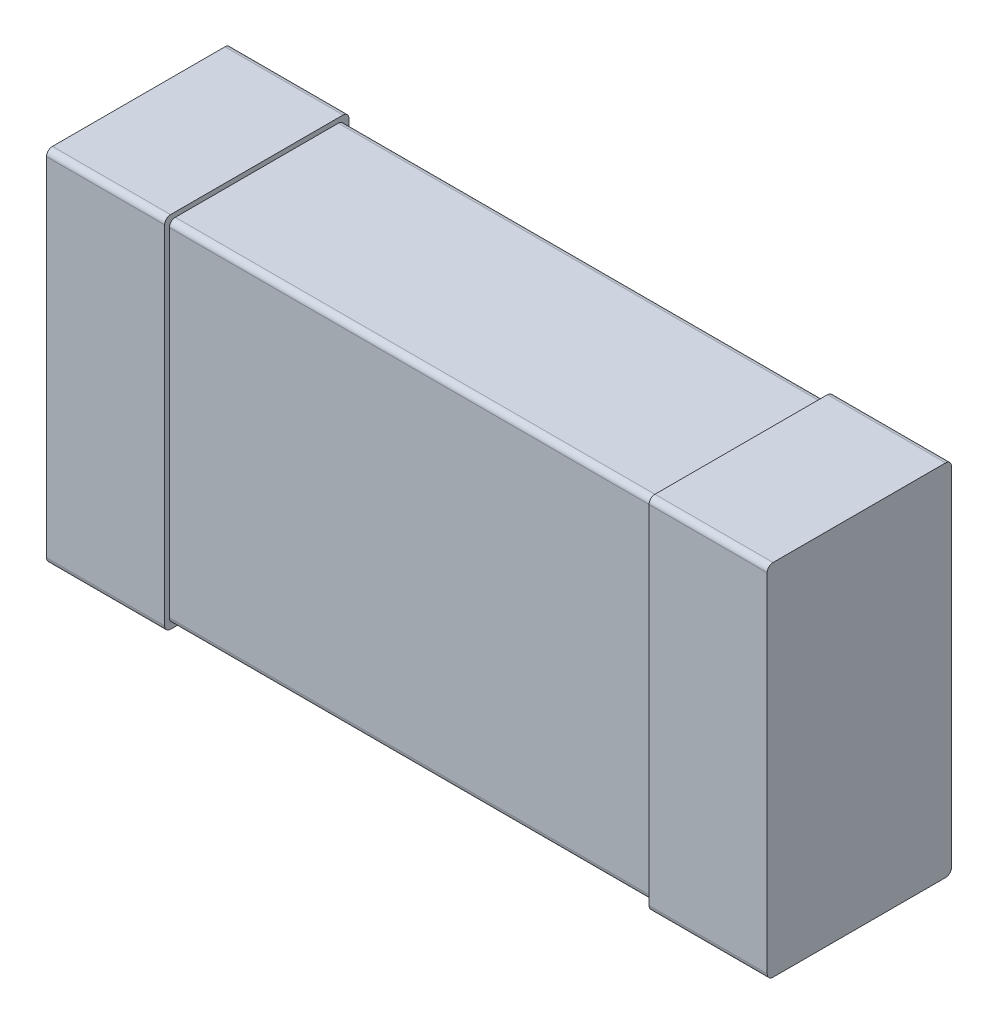
ISO-10303-21;
HEADER;
FILE_DESCRIPTION(('STEP AP214'),'2;1');
FILE_NAME('part.step','',(''),(''),'','','');
FILE_SCHEMA(('AUTOMOTIVE_DESIGN { 1 0 10303 214 1 1 1 1 }'));
ENDSEC;
DATA;
#1=APPLICATION_CONTEXT('core data for automotive mechanical design processes');
#2=APPLICATION_PROTOCOL_DEFINITION('international standard','automotive_design',2000,#1);
#3=PRODUCT_CONTEXT('',#1,'mechanical');
#4=PRODUCT('Part','Part','',(#3));
#5=PRODUCT_RELATED_PRODUCT_CATEGORY('part','',(#4));
#6=PRODUCT_DEFINITION_FORMATION('','',#4);
#7=PRODUCT_DEFINITION_CONTEXT('part definition',#1,'design');
#8=PRODUCT_DEFINITION('design','',#6,#7);
#9=PRODUCT_DEFINITION_SHAPE('','',#8);
#10=(LENGTH_UNIT() NAMED_UNIT(*) SI_UNIT(.MILLI.,.METRE.));
#11=(NAMED_UNIT(*) PLANE_ANGLE_UNIT() SI_UNIT($,.RADIAN.));
#12=(NAMED_UNIT(*) SI_UNIT($,.STERADIAN.) SOLID_ANGLE_UNIT());
#13=UNCERTAINTY_MEASURE_WITH_UNIT(LENGTH_MEASURE(1.E-05),#10,'distance_accuracy_value','');
#14=(GEOMETRIC_REPRESENTATION_CONTEXT(3) GLOBAL_UNCERTAINTY_ASSIGNED_CONTEXT((#13)) GLOBAL_UNIT_ASSIGNED_CONTEXT((#10,
#11,#12)) REPRESENTATION_CONTEXT('',''));
#15=CARTESIAN_POINT('',(0.,0.,0.));
#16=DIRECTION('',(0.,0.,1.));
#17=DIRECTION('',(1.,0.,0.));
#18=AXIS2_PLACEMENT_3D('',#15,#16,#17);
#19=CARTESIAN_POINT('',(-1.025,-0.74,0.76));
#20=DIRECTION('',(0.,0.,1.));
#21=DIRECTION('',(1.,0.,0.));
#22=AXIS2_PLACEMENT_3D('',#19,#20,#21);
#23=PLANE('',#22);
#24=DIRECTION('',(0.,1.,0.));
#25=VECTOR('',#24,1.);
#26=CARTESIAN_POINT('',(1.025,-0.74,0.76));
#27=LINE('',#26,#25);
#28=CARTESIAN_POINT('',(1.025,-0.715,0.76));
#29=VERTEX_POINT('',#28);
#30=CARTESIAN_POINT('',(1.025,0.715,0.76));
#31=VERTEX_POINT('',#30);
#32=EDGE_CURVE('E183',#29,#31,#27,.T.);
#33=ORIENTED_EDGE('',*,*,#32,.T.);
#34=DIRECTION('',(1.,0.,0.));
#35=VECTOR('',#34,1.);
#36=CARTESIAN_POINT('',(-1.025,0.715,0.76));
#37=LINE('',#36,#35);
#38=CARTESIAN_POINT('',(-1.025,0.715,0.76));
#39=VERTEX_POINT('',#38);
#40=EDGE_CURVE('E246',#39,#31,#37,.T.);
#41=ORIENTED_EDGE('',*,*,#40,.F.);
#42=DIRECTION('',(0.,1.,0.));
#43=VECTOR('',#42,1.);
#44=CARTESIAN_POINT('',(-1.025,-0.74,0.76));
#45=LINE('',#44,#43);
#46=CARTESIAN_POINT('',(-1.025,-0.715,0.76));
#47=VERTEX_POINT('',#46);
#48=EDGE_CURVE('E251',#39,#47,#45,.F.);
#49=ORIENTED_EDGE('',*,*,#48,.T.);
#50=DIRECTION('',(1.,0.,0.));
#51=VECTOR('',#50,1.);
#52=CARTESIAN_POINT('',(-1.025,-0.715,0.76));
#53=LINE('',#52,#51);
#54=EDGE_CURVE('E253',#29,#47,#53,.F.);
#55=ORIENTED_EDGE('',*,*,#54,.F.);
#56=EDGE_LOOP('',(#33,#41,#49,#55));
#57=FACE_BOUND('',#56,.T.);
#58=ADVANCED_FACE('F17',(#57),#23,.T.);
#59=CARTESIAN_POINT('',(-1.525,-0.76,0.));
#60=DIRECTION('',(1.,0.,0.));
#61=DIRECTION('',(0.,0.,-1.));
#62=AXIS2_PLACEMENT_3D('',#59,#60,#61);
#63=PLANE('',#62);
#64=DIRECTION('',(0.,1.,0.));
#65=VECTOR('',#64,1.);
#66=CARTESIAN_POINT('',(-1.525,-0.76,0.78));
#67=LINE('',#66,#65);
#68=CARTESIAN_POINT('',(-1.525,0.735,0.78));
#69=VERTEX_POINT('',#68);
#70=CARTESIAN_POINT('',(-1.525,-0.735,0.78));
#71=VERTEX_POINT('',#70);
#72=EDGE_CURVE('E202',#69,#71,#67,.F.);
#73=ORIENTED_EDGE('',*,*,#72,.F.);
#74=CARTESIAN_POINT('',(-1.525,0.735,0.755));
#75=DIRECTION('',(1.,0.,0.));
#76=DIRECTION('',(0.,0.,-1.));
#77=AXIS2_PLACEMENT_3D('',#74,#75,#76);
#78=CIRCLE('',#77,0.025);
#79=CARTESIAN_POINT('',(-1.525,0.76,0.755));
#80=VERTEX_POINT('',#79);
#81=EDGE_CURVE('E211',#80,#69,#78,.T.);
#82=ORIENTED_EDGE('',*,*,#81,.F.);
#83=DIRECTION('',(0.,0.,1.));
#84=VECTOR('',#83,1.);
#85=CARTESIAN_POINT('',(-1.525,0.76,0.));
#86=LINE('',#85,#84);
#87=CARTESIAN_POINT('',(-1.525,0.76,0.025));
#88=VERTEX_POINT('',#87);
#89=EDGE_CURVE('E215',#88,#80,#86,.T.);
#90=ORIENTED_EDGE('',*,*,#89,.F.);
#91=CARTESIAN_POINT('',(-1.525,0.735,0.025));
#92=DIRECTION('',(1.,0.,0.));
#93=DIRECTION('',(0.,0.,-1.));
#94=AXIS2_PLACEMENT_3D('',#91,#92,#93);
#95=CIRCLE('',#94,0.025);
#96=CARTESIAN_POINT('',(-1.525,0.735,0.));
#97=VERTEX_POINT('',#96);
#98=EDGE_CURVE('E216',#97,#88,#95,.T.);
#99=ORIENTED_EDGE('',*,*,#98,.F.);
#100=DIRECTION('',(0.,1.,0.));
#101=VECTOR('',#100,1.);
#102=CARTESIAN_POINT('',(-1.525,-0.76,0.));
#103=LINE('',#102,#101);
#104=CARTESIAN_POINT('',(-1.525,-0.735,0.));
#105=VERTEX_POINT('',#104);
#106=EDGE_CURVE('E223',#97,#105,#103,.F.);
#107=ORIENTED_EDGE('',*,*,#106,.T.);
#108=CARTESIAN_POINT('',(-1.525,-0.735,0.025));
#109=DIRECTION('',(1.,0.,0.));
#110=DIRECTION('',(0.,0.,-1.));
#111=AXIS2_PLACEMENT_3D('',#108,#109,#110);
#112=CIRCLE('',#111,0.025);
#113=CARTESIAN_POINT('',(-1.525,-0.76,0.025));
#114=VERTEX_POINT('',#113);
#115=EDGE_CURVE('E188',#114,#105,#112,.T.);
#116=ORIENTED_EDGE('',*,*,#115,.F.);
#117=DIRECTION('',(0.,0.,1.));
#118=VECTOR('',#117,1.);
#119=CARTESIAN_POINT('',(-1.525,-0.76,0.));
#120=LINE('',#119,#118);
#121=CARTESIAN_POINT('',(-1.525,-0.76,0.755));
#122=VERTEX_POINT('',#121);
#123=EDGE_CURVE('E185',#114,#122,#120,.T.);
#124=ORIENTED_EDGE('',*,*,#123,.T.);
#125=CARTESIAN_POINT('',(-1.525,-0.735,0.755));
#126=DIRECTION('',(1.,0.,0.));
#127=DIRECTION('',(0.,0.,-1.));
#128=AXIS2_PLACEMENT_3D('',#125,#126,#127);
#129=CIRCLE('',#128,0.025);
#130=EDGE_CURVE('E20',#71,#122,#129,.T.);
#131=ORIENTED_EDGE('',*,*,#130,.F.);
#132=EDGE_LOOP('',(#73,#82,#90,#99,#107,#116,#124,#131));
#133=FACE_BOUND('',#132,.T.);
#134=ADVANCED_FACE('F186',(#133),#63,.F.);
#135=CARTESIAN_POINT('',(-1.025,-0.715,0.735));
#136=DIRECTION('',(1.,0.,0.));
#137=DIRECTION('',(0.,0.,-1.));
#138=AXIS2_PLACEMENT_3D('',#135,#136,#137);
#139=CYLINDRICAL_SURFACE('',#138,0.025);
#140=ORIENTED_EDGE('',*,*,#54,.T.);
#141=CARTESIAN_POINT('',(-1.025,-0.715,0.735));
#142=DIRECTION('',(1.,0.,0.));
#143=DIRECTION('',(0.,0.,-1.));
#144=AXIS2_PLACEMENT_3D('',#141,#142,#143);
#145=CIRCLE('',#144,0.025);
#146=CARTESIAN_POINT('',(-1.025,-0.74,0.735));
#147=VERTEX_POINT('',#146);
#148=EDGE_CURVE('E256',#47,#147,#145,.T.);
#149=ORIENTED_EDGE('',*,*,#148,.T.);
#150=DIRECTION('',(1.,0.,0.));
#151=VECTOR('',#150,1.);
#152=CARTESIAN_POINT('',(-1.025,-0.74,0.735));
#153=LINE('',#152,#151);
#154=CARTESIAN_POINT('',(1.025,-0.74,0.735));
#155=VERTEX_POINT('',#154);
#156=EDGE_CURVE('E205',#147,#155,#153,.T.);
#157=ORIENTED_EDGE('',*,*,#156,.T.);
#158=CARTESIAN_POINT('',(1.025,-0.715,0.735));
#159=DIRECTION('',(1.,0.,0.));
#160=DIRECTION('',(0.,0.,-1.));
#161=AXIS2_PLACEMENT_3D('',#158,#159,#160);
#162=CIRCLE('',#161,0.025);
#163=EDGE_CURVE('E182',#155,#29,#162,.F.);
#164=ORIENTED_EDGE('',*,*,#163,.T.);
#165=EDGE_LOOP('',(#140,#149,#157,#164));
#166=FACE_BOUND('',#165,.T.);
#167=ADVANCED_FACE('F315',(#166),#139,.T.);
#168=CARTESIAN_POINT('',(1.525,-0.76,0.));
#169=DIRECTION('',(1.,0.,0.));
#170=DIRECTION('',(0.,0.,-1.));
#171=AXIS2_PLACEMENT_3D('',#168,#169,#170);
#172=PLANE('',#171);
#173=DIRECTION('',(0.,1.,0.));
#174=VECTOR('',#173,1.);
#175=CARTESIAN_POINT('',(1.525,-0.76,0.78));
#176=LINE('',#175,#174);
#177=CARTESIAN_POINT('',(1.525,-0.735,0.78));
#178=VERTEX_POINT('',#177);
#179=CARTESIAN_POINT('',(1.525,0.735,0.78));
#180=VERTEX_POINT('',#179);
#181=EDGE_CURVE('E226',#178,#180,#176,.T.);
#182=ORIENTED_EDGE('',*,*,#181,.F.);
#183=CARTESIAN_POINT('',(1.525,-0.735,0.755));
#184=DIRECTION('',(1.,0.,0.));
#185=DIRECTION('',(0.,0.,-1.));
#186=AXIS2_PLACEMENT_3D('',#183,#184,#185);
#187=CIRCLE('',#186,0.025);
#188=CARTESIAN_POINT('',(1.525,-0.76,0.755));
#189=VERTEX_POINT('',#188);
#190=EDGE_CURVE('E309',#178,#189,#187,.T.);
#191=ORIENTED_EDGE('',*,*,#190,.T.);
#192=DIRECTION('',(0.,0.,1.));
#193=VECTOR('',#192,1.);
#194=CARTESIAN_POINT('',(1.525,-0.76,0.));
#195=LINE('',#194,#193);
#196=CARTESIAN_POINT('',(1.525,-0.76,0.025));
#197=VERTEX_POINT('',#196);
#198=EDGE_CURVE('E230',#189,#197,#195,.F.);
#199=ORIENTED_EDGE('',*,*,#198,.T.);
#200=CARTESIAN_POINT('',(1.525,-0.735,0.025));
#201=DIRECTION('',(1.,0.,0.));
#202=DIRECTION('',(0.,0.,-1.));
#203=AXIS2_PLACEMENT_3D('',#200,#201,#202);
#204=CIRCLE('',#203,0.025);
#205=CARTESIAN_POINT('',(1.525,-0.735,0.));
#206=VERTEX_POINT('',#205);
#207=EDGE_CURVE('E233',#206,#197,#204,.F.);
#208=ORIENTED_EDGE('',*,*,#207,.F.);
#209=DIRECTION('',(0.,1.,0.));
#210=VECTOR('',#209,1.);
#211=CARTESIAN_POINT('',(1.525,-0.76,0.));
#212=LINE('',#211,#210);
#213=CARTESIAN_POINT('',(1.525,0.735,0.));
#214=VERTEX_POINT('',#213);
#215=EDGE_CURVE('E238',#206,#214,#212,.T.);
#216=ORIENTED_EDGE('',*,*,#215,.T.);
#217=CARTESIAN_POINT('',(1.525,0.735,0.025));
#218=DIRECTION('',(1.,0.,0.));
#219=DIRECTION('',(0.,0.,-1.));
#220=AXIS2_PLACEMENT_3D('',#217,#218,#219);
#221=CIRCLE('',#220,0.025);
#222=CARTESIAN_POINT('',(1.525,0.76,0.025));
#223=VERTEX_POINT('',#222);
#224=EDGE_CURVE('E241',#223,#214,#221,.F.);
#225=ORIENTED_EDGE('',*,*,#224,.F.);
#226=DIRECTION('',(0.,0.,1.));
#227=VECTOR('',#226,1.);
#228=CARTESIAN_POINT('',(1.525,0.76,0.));
#229=LINE('',#228,#227);
#230=CARTESIAN_POINT('',(1.525,0.76,0.755));
#231=VERTEX_POINT('',#230);
#232=EDGE_CURVE('E234',#231,#223,#229,.F.);
#233=ORIENTED_EDGE('',*,*,#232,.F.);
#234=CARTESIAN_POINT('',(1.525,0.735,0.755));
#235=DIRECTION('',(1.,0.,0.));
#236=DIRECTION('',(0.,0.,-1.));
#237=AXIS2_PLACEMENT_3D('',#234,#235,#236);
#238=CIRCLE('',#237,0.025);
#239=EDGE_CURVE('E299',#180,#231,#238,.F.);
#240=ORIENTED_EDGE('',*,*,#239,.F.);
#241=EDGE_LOOP('',(#182,#191,#199,#208,#216,#225,#233,#240));
#242=FACE_BOUND('',#241,.T.);
#243=ADVANCED_FACE('F473',(#242),#172,.T.);
#244=CARTESIAN_POINT('',(-1.025,0.715,0.735));
#245=DIRECTION('',(1.,0.,0.));
#246=DIRECTION('',(0.,0.,-1.));
#247=AXIS2_PLACEMENT_3D('',#244,#245,#246);
#248=CYLINDRICAL_SURFACE('',#247,0.025);
#249=CARTESIAN_POINT('',(1.025,0.715,0.735));
#250=DIRECTION('',(1.,0.,0.));
#251=DIRECTION('',(0.,0.,-1.));
#252=AXIS2_PLACEMENT_3D('',#249,#250,#251);
#253=CIRCLE('',#252,0.025);
#254=CARTESIAN_POINT('',(1.025,0.74,0.735));
#255=VERTEX_POINT('',#254);
#256=EDGE_CURVE('E192',#31,#255,#253,.F.);
#257=ORIENTED_EDGE('',*,*,#256,.T.);
#258=DIRECTION('',(1.,0.,0.));
#259=VECTOR('',#258,1.);
#260=CARTESIAN_POINT('',(-1.025,0.74,0.735));
#261=LINE('',#260,#259);
#262=CARTESIAN_POINT('',(-1.025,0.74,0.735));
#263=VERTEX_POINT('',#262);
#264=EDGE_CURVE('E352',#263,#255,#261,.T.);
#265=ORIENTED_EDGE('',*,*,#264,.F.);
#266=CARTESIAN_POINT('',(-1.025,0.715,0.735));
#267=DIRECTION('',(1.,0.,0.));
#268=DIRECTION('',(0.,0.,-1.));
#269=AXIS2_PLACEMENT_3D('',#266,#267,#268);
#270=CIRCLE('',#269,0.025);
#271=EDGE_CURVE('E249',#263,#39,#270,.T.);
#272=ORIENTED_EDGE('',*,*,#271,.T.);
#273=ORIENTED_EDGE('',*,*,#40,.T.);
#274=EDGE_LOOP('',(#257,#265,#272,#273));
#275=FACE_BOUND('',#274,.T.);
#276=ADVANCED_FACE('F470',(#275),#248,.T.);
#277=CARTESIAN_POINT('',(-1.525,-0.76,0.));
#278=DIRECTION('',(0.,1.,0.));
#279=DIRECTION('',(0.,0.,1.));
#280=AXIS2_PLACEMENT_3D('',#277,#278,#279);
#281=PLANE('',#280);
#282=ORIENTED_EDGE('',*,*,#123,.F.);
#283=DIRECTION('',(1.,0.,0.));
#284=VECTOR('',#283,1.);
#285=CARTESIAN_POINT('',(-1.525,-0.76,0.025));
#286=LINE('',#285,#284);
#287=CARTESIAN_POINT('',(-1.025,-0.76,0.025));
#288=VERTEX_POINT('',#287);
#289=EDGE_CURVE('E224',#288,#114,#286,.F.);
#290=ORIENTED_EDGE('',*,*,#289,.F.);
#291=DIRECTION('',(0.,0.,-1.));
#292=VECTOR('',#291,1.);
#293=CARTESIAN_POINT('',(-1.025,-0.76,0.));
#294=LINE('',#293,#292);
#295=CARTESIAN_POINT('',(-1.025,-0.76,0.755));
#296=VERTEX_POINT('',#295);
#297=EDGE_CURVE('E196',#296,#288,#294,.T.);
#298=ORIENTED_EDGE('',*,*,#297,.F.);
#299=DIRECTION('',(1.,0.,0.));
#300=VECTOR('',#299,1.);
#301=CARTESIAN_POINT('',(-1.525,-0.76,0.755));
#302=LINE('',#301,#300);
#303=EDGE_CURVE('E178',#122,#296,#302,.T.);
#304=ORIENTED_EDGE('',*,*,#303,.F.);
#305=EDGE_LOOP('',(#282,#290,#298,#304));
#306=FACE_BOUND('',#305,.T.);
#307=ADVANCED_FACE('F195',(#306),#281,.F.);
#308=CARTESIAN_POINT('',(-1.525,-0.735,0.025));
#309=DIRECTION('',(1.,0.,0.));
#310=DIRECTION('',(0.,0.,-1.));
#311=AXIS2_PLACEMENT_3D('',#308,#309,#310);
#312=CYLINDRICAL_SURFACE('',#311,0.025);
#313=CARTESIAN_POINT('',(-1.025,-0.735,0.025));
#314=DIRECTION('',(1.,0.,0.));
#315=DIRECTION('',(0.,0.,-1.));
#316=AXIS2_PLACEMENT_3D('',#313,#314,#315);
#317=CIRCLE('',#316,0.025);
#318=CARTESIAN_POINT('',(-1.025,-0.735,0.));
#319=VERTEX_POINT('',#318);
#320=EDGE_CURVE('E297',#288,#319,#317,.T.);
#321=ORIENTED_EDGE('',*,*,#320,.F.);
#322=ORIENTED_EDGE('',*,*,#289,.T.);
#323=ORIENTED_EDGE('',*,*,#115,.T.);
#324=DIRECTION('',(1.,0.,0.));
#325=VECTOR('',#324,1.);
#326=CARTESIAN_POINT('',(-1.525,-0.735,0.));
#327=LINE('',#326,#325);
#328=EDGE_CURVE('E220',#105,#319,#327,.T.);
#329=ORIENTED_EDGE('',*,*,#328,.T.);
#330=EDGE_LOOP('',(#321,#322,#323,#329));
#331=FACE_BOUND('',#330,.T.);
#332=ADVANCED_FACE('F463',(#331),#312,.T.);
#333=CARTESIAN_POINT('',(-1.525,-0.76,0.));
#334=DIRECTION('',(0.,0.,1.));
#335=DIRECTION('',(1.,0.,0.));
#336=AXIS2_PLACEMENT_3D('',#333,#334,#335);
#337=PLANE('',#336);
#338=DIRECTION('',(0.,1.,0.));
#339=VECTOR('',#338,1.);
#340=CARTESIAN_POINT('',(-1.025,-0.76,0.));
#341=LINE('',#340,#339);
#342=CARTESIAN_POINT('',(-1.025,0.735,0.));
#343=VERTEX_POINT('',#342);
#344=EDGE_CURVE('E296',#319,#343,#341,.T.);
#345=ORIENTED_EDGE('',*,*,#344,.F.);
#346=ORIENTED_EDGE('',*,*,#328,.F.);
#347=ORIENTED_EDGE('',*,*,#106,.F.);
#348=DIRECTION('',(1.,0.,0.));
#349=VECTOR('',#348,1.);
#350=CARTESIAN_POINT('',(-1.525,0.735,0.));
#351=LINE('',#350,#349);
#352=EDGE_CURVE('E217',#343,#97,#351,.F.);
#353=ORIENTED_EDGE('',*,*,#352,.F.);
#354=EDGE_LOOP('',(#345,#346,#347,#353));
#355=FACE_BOUND('',#354,.T.);
#356=ADVANCED_FACE('F459',(#355),#337,.F.);
#357=CARTESIAN_POINT('',(-1.525,0.735,0.025));
#358=DIRECTION('',(1.,0.,0.));
#359=DIRECTION('',(0.,0.,-1.));
#360=AXIS2_PLACEMENT_3D('',#357,#358,#359);
#361=CYLINDRICAL_SURFACE('',#360,0.025);
#362=ORIENTED_EDGE('',*,*,#352,.T.);
#363=ORIENTED_EDGE('',*,*,#98,.T.);
#364=DIRECTION('',(1.,0.,0.));
#365=VECTOR('',#364,1.);
#366=CARTESIAN_POINT('',(-1.525,0.76,0.025));
#367=LINE('',#366,#365);
#368=CARTESIAN_POINT('',(-1.025,0.76,0.025));
#369=VERTEX_POINT('',#368);
#370=EDGE_CURVE('E212',#369,#88,#367,.F.);
#371=ORIENTED_EDGE('',*,*,#370,.F.);
#372=CARTESIAN_POINT('',(-1.025,0.735,0.025));
#373=DIRECTION('',(1.,0.,0.));
#374=DIRECTION('',(0.,0.,-1.));
#375=AXIS2_PLACEMENT_3D('',#372,#373,#374);
#376=CIRCLE('',#375,0.025);
#377=EDGE_CURVE('E294',#343,#369,#376,.T.);
#378=ORIENTED_EDGE('',*,*,#377,.F.);
#379=EDGE_LOOP('',(#362,#363,#371,#378));
#380=FACE_BOUND('',#379,.T.);
#381=ADVANCED_FACE('F455',(#380),#361,.T.);
#382=CARTESIAN_POINT('',(-1.525,0.76,0.));
#383=DIRECTION('',(0.,1.,0.));
#384=DIRECTION('',(0.,0.,1.));
#385=AXIS2_PLACEMENT_3D('',#382,#383,#384);
#386=PLANE('',#385);
#387=ORIENTED_EDGE('',*,*,#89,.T.);
#388=DIRECTION('',(1.,0.,0.));
#389=VECTOR('',#388,1.);
#390=CARTESIAN_POINT('',(-1.525,0.76,0.755));
#391=LINE('',#390,#389);
#392=CARTESIAN_POINT('',(-1.025,0.76,0.755));
#393=VERTEX_POINT('',#392);
#394=EDGE_CURVE('E208',#393,#80,#391,.F.);
#395=ORIENTED_EDGE('',*,*,#394,.F.);
#396=DIRECTION('',(0.,0.,-1.));
#397=VECTOR('',#396,1.);
#398=CARTESIAN_POINT('',(-1.025,0.76,0.));
#399=LINE('',#398,#397);
#400=EDGE_CURVE('E293',#369,#393,#399,.F.);
#401=ORIENTED_EDGE('',*,*,#400,.F.);
#402=ORIENTED_EDGE('',*,*,#370,.T.);
#403=EDGE_LOOP('',(#387,#395,#401,#402));
#404=FACE_BOUND('',#403,.T.);
#405=ADVANCED_FACE('F451',(#404),#386,.T.);
#406=CARTESIAN_POINT('',(-1.525,0.735,0.755));
#407=DIRECTION('',(1.,0.,0.));
#408=DIRECTION('',(0.,0.,-1.));
#409=AXIS2_PLACEMENT_3D('',#406,#407,#408);
#410=CYLINDRICAL_SURFACE('',#409,0.025);
#411=CARTESIAN_POINT('',(-1.025,0.735,0.755));
#412=DIRECTION('',(1.,0.,0.));
#413=DIRECTION('',(0.,0.,-1.));
#414=AXIS2_PLACEMENT_3D('',#411,#412,#413);
#415=CIRCLE('',#414,0.025);
#416=CARTESIAN_POINT('',(-1.025,0.735,0.78));
#417=VERTEX_POINT('',#416);
#418=EDGE_CURVE('E291',#393,#417,#415,.T.);
#419=ORIENTED_EDGE('',*,*,#418,.F.);
#420=ORIENTED_EDGE('',*,*,#394,.T.);
#421=ORIENTED_EDGE('',*,*,#81,.T.);
#422=DIRECTION('',(1.,0.,0.));
#423=VECTOR('',#422,1.);
#424=CARTESIAN_POINT('',(-1.525,0.735,0.78));
#425=LINE('',#424,#423);
#426=EDGE_CURVE('E197',#417,#69,#425,.F.);
#427=ORIENTED_EDGE('',*,*,#426,.F.);
#428=EDGE_LOOP('',(#419,#420,#421,#427));
#429=FACE_BOUND('',#428,.T.);
#430=ADVANCED_FACE('F447',(#429),#410,.T.);
#431=CARTESIAN_POINT('',(-1.525,-0.76,0.78));
#432=DIRECTION('',(0.,0.,1.));
#433=DIRECTION('',(1.,0.,0.));
#434=AXIS2_PLACEMENT_3D('',#431,#432,#433);
#435=PLANE('',#434);
#436=DIRECTION('',(0.,1.,0.));
#437=VECTOR('',#436,1.);
#438=CARTESIAN_POINT('',(-1.025,-0.76,0.78));
#439=LINE('',#438,#437);
#440=CARTESIAN_POINT('',(-1.025,-0.735,0.78));
#441=VERTEX_POINT('',#440);
#442=EDGE_CURVE('E290',#417,#441,#439,.F.);
#443=ORIENTED_EDGE('',*,*,#442,.F.);
#444=ORIENTED_EDGE('',*,*,#426,.T.);
#445=ORIENTED_EDGE('',*,*,#72,.T.);
#446=DIRECTION('',(1.,0.,0.));
#447=VECTOR('',#446,1.);
#448=CARTESIAN_POINT('',(-1.525,-0.735,0.78));
#449=LINE('',#448,#447);
#450=EDGE_CURVE('E181',#441,#71,#449,.F.);
#451=ORIENTED_EDGE('',*,*,#450,.F.);
#452=EDGE_LOOP('',(#443,#444,#445,#451));
#453=FACE_BOUND('',#452,.T.);
#454=ADVANCED_FACE('F444',(#453),#435,.T.);
#455=CARTESIAN_POINT('',(-1.525,-0.735,0.755));
#456=DIRECTION('',(1.,0.,0.));
#457=DIRECTION('',(0.,0.,-1.));
#458=AXIS2_PLACEMENT_3D('',#455,#456,#457);
#459=CYLINDRICAL_SURFACE('',#458,0.025);
#460=ORIENTED_EDGE('',*,*,#450,.T.);
#461=ORIENTED_EDGE('',*,*,#130,.T.);
#462=ORIENTED_EDGE('',*,*,#303,.T.);
#463=CARTESIAN_POINT('',(-1.025,-0.735,0.755));
#464=DIRECTION('',(1.,0.,0.));
#465=DIRECTION('',(0.,0.,-1.));
#466=AXIS2_PLACEMENT_3D('',#463,#464,#465);
#467=CIRCLE('',#466,0.025);
#468=EDGE_CURVE('E287',#441,#296,#467,.T.);
#469=ORIENTED_EDGE('',*,*,#468,.F.);
#470=EDGE_LOOP('',(#460,#461,#462,#469));
#471=FACE_BOUND('',#470,.T.);
#472=ADVANCED_FACE('F175',(#471),#459,.T.);
#473=CARTESIAN_POINT('',(-1.025,-0.74,0.02));
#474=DIRECTION('',(0.,1.,0.));
#475=DIRECTION('',(0.,0.,1.));
#476=AXIS2_PLACEMENT_3D('',#473,#474,#475);
#477=PLANE('',#476);
#478=DIRECTION('',(0.,0.,-1.));
#479=VECTOR('',#478,1.);
#480=CARTESIAN_POINT('',(-1.025,-0.74,0.));
#481=LINE('',#480,#479);
#482=CARTESIAN_POINT('',(-1.025,-0.74,0.045));
#483=VERTEX_POINT('',#482);
#484=EDGE_CURVE('E289',#483,#147,#481,.F.);
#485=ORIENTED_EDGE('',*,*,#484,.F.);
#486=DIRECTION('',(1.,0.,0.));
#487=VECTOR('',#486,1.);
#488=CARTESIAN_POINT('',(-1.025,-0.74,0.045));
#489=LINE('',#488,#487);
#490=CARTESIAN_POINT('',(1.025,-0.74,0.045));
#491=VERTEX_POINT('',#490);
#492=EDGE_CURVE('E285',#491,#483,#489,.F.);
#493=ORIENTED_EDGE('',*,*,#492,.F.);
#494=DIRECTION('',(0.,0.,1.));
#495=VECTOR('',#494,1.);
#496=CARTESIAN_POINT('',(1.025,-0.74,0.02));
#497=LINE('',#496,#495);
#498=EDGE_CURVE('E199',#155,#491,#497,.F.);
#499=ORIENTED_EDGE('',*,*,#498,.F.);
#500=ORIENTED_EDGE('',*,*,#156,.F.);
#501=EDGE_LOOP('',(#485,#493,#499,#500));
#502=FACE_BOUND('',#501,.T.);
#503=ADVANCED_FACE('F336',(#502),#477,.F.);
#504=CARTESIAN_POINT('',(1.025,-0.76,0.));
#505=DIRECTION('',(0.,1.,0.));
#506=DIRECTION('',(0.,0.,1.));
#507=AXIS2_PLACEMENT_3D('',#504,#505,#506);
#508=PLANE('',#507);
#509=DIRECTION('',(0.,0.,-1.));
#510=VECTOR('',#509,1.);
#511=CARTESIAN_POINT('',(1.025,-0.76,0.));
#512=LINE('',#511,#510);
#513=CARTESIAN_POINT('',(1.025,-0.76,0.755));
#514=VERTEX_POINT('',#513);
#515=CARTESIAN_POINT('',(1.025,-0.76,0.025));
#516=VERTEX_POINT('',#515);
#517=EDGE_CURVE('E282',#514,#516,#512,.T.);
#518=ORIENTED_EDGE('',*,*,#517,.T.);
#519=DIRECTION('',(1.,0.,0.));
#520=VECTOR('',#519,1.);
#521=CARTESIAN_POINT('',(1.025,-0.76,0.025));
#522=LINE('',#521,#520);
#523=EDGE_CURVE('E303',#197,#516,#522,.F.);
#524=ORIENTED_EDGE('',*,*,#523,.F.);
#525=ORIENTED_EDGE('',*,*,#198,.F.);
#526=DIRECTION('',(1.,0.,0.));
#527=VECTOR('',#526,1.);
#528=CARTESIAN_POINT('',(1.025,-0.76,0.755));
#529=LINE('',#528,#527);
#530=EDGE_CURVE('E347',#514,#189,#529,.T.);
#531=ORIENTED_EDGE('',*,*,#530,.F.);
#532=EDGE_LOOP('',(#518,#524,#525,#531));
#533=FACE_BOUND('',#532,.T.);
#534=ADVANCED_FACE('F435',(#533),#508,.F.);
#535=CARTESIAN_POINT('',(1.025,-0.735,0.025));
#536=DIRECTION('',(1.,0.,0.));
#537=DIRECTION('',(0.,0.,-1.));
#538=AXIS2_PLACEMENT_3D('',#535,#536,#537);
#539=CYLINDRICAL_SURFACE('',#538,0.025);
#540=ORIENTED_EDGE('',*,*,#207,.T.);
#541=ORIENTED_EDGE('',*,*,#523,.T.);
#542=CARTESIAN_POINT('',(1.025,-0.735,0.025));
#543=DIRECTION('',(1.,0.,0.));
#544=DIRECTION('',(0.,0.,-1.));
#545=AXIS2_PLACEMENT_3D('',#542,#543,#544);
#546=CIRCLE('',#545,0.025);
#547=CARTESIAN_POINT('',(1.025,-0.735,0.));
#548=VERTEX_POINT('',#547);
#549=EDGE_CURVE('E279',#516,#548,#546,.T.);
#550=ORIENTED_EDGE('',*,*,#549,.T.);
#551=DIRECTION('',(1.,0.,0.));
#552=VECTOR('',#551,1.);
#553=CARTESIAN_POINT('',(1.025,-0.735,0.));
#554=LINE('',#553,#552);
#555=EDGE_CURVE('E242',#548,#206,#554,.T.);
#556=ORIENTED_EDGE('',*,*,#555,.T.);
#557=EDGE_LOOP('',(#540,#541,#550,#556));
#558=FACE_BOUND('',#557,.T.);
#559=ADVANCED_FACE('F431',(#558),#539,.T.);
#560=CARTESIAN_POINT('',(1.025,-0.76,0.));
#561=DIRECTION('',(0.,0.,1.));
#562=DIRECTION('',(1.,0.,0.));
#563=AXIS2_PLACEMENT_3D('',#560,#561,#562);
#564=PLANE('',#563);
#565=ORIENTED_EDGE('',*,*,#215,.F.);
#566=ORIENTED_EDGE('',*,*,#555,.F.);
#567=DIRECTION('',(0.,1.,0.));
#568=VECTOR('',#567,1.);
#569=CARTESIAN_POINT('',(1.025,-0.76,0.));
#570=LINE('',#569,#568);
#571=CARTESIAN_POINT('',(1.025,0.735,0.));
#572=VERTEX_POINT('',#571);
#573=EDGE_CURVE('E278',#548,#572,#570,.T.);
#574=ORIENTED_EDGE('',*,*,#573,.T.);
#575=DIRECTION('',(1.,0.,0.));
#576=VECTOR('',#575,1.);
#577=CARTESIAN_POINT('',(1.025,0.735,0.));
#578=LINE('',#577,#576);
#579=EDGE_CURVE('E237',#214,#572,#578,.F.);
#580=ORIENTED_EDGE('',*,*,#579,.F.);
#581=EDGE_LOOP('',(#565,#566,#574,#580));
#582=FACE_BOUND('',#581,.T.);
#583=ADVANCED_FACE('F427',(#582),#564,.F.);
#584=CARTESIAN_POINT('',(1.025,0.735,0.025));
#585=DIRECTION('',(1.,0.,0.));
#586=DIRECTION('',(0.,0.,-1.));
#587=AXIS2_PLACEMENT_3D('',#584,#585,#586);
#588=CYLINDRICAL_SURFACE('',#587,0.025);
#589=ORIENTED_EDGE('',*,*,#579,.T.);
#590=CARTESIAN_POINT('',(1.025,0.735,0.025));
#591=DIRECTION('',(1.,0.,0.));
#592=DIRECTION('',(0.,0.,-1.));
#593=AXIS2_PLACEMENT_3D('',#590,#591,#592);
#594=CIRCLE('',#593,0.025);
#595=CARTESIAN_POINT('',(1.025,0.76,0.025));
#596=VERTEX_POINT('',#595);
#597=EDGE_CURVE('E275',#572,#596,#594,.T.);
#598=ORIENTED_EDGE('',*,*,#597,.T.);
#599=DIRECTION('',(1.,0.,0.));
#600=VECTOR('',#599,1.);
#601=CARTESIAN_POINT('',(1.025,0.76,0.025));
#602=LINE('',#601,#600);
#603=EDGE_CURVE('E236',#223,#596,#602,.F.);
#604=ORIENTED_EDGE('',*,*,#603,.F.);
#605=ORIENTED_EDGE('',*,*,#224,.T.);
#606=EDGE_LOOP('',(#589,#598,#604,#605));
#607=FACE_BOUND('',#606,.T.);
#608=ADVANCED_FACE('F423',(#607),#588,.T.);
#609=CARTESIAN_POINT('',(1.025,0.76,0.));
#610=DIRECTION('',(0.,1.,0.));
#611=DIRECTION('',(0.,0.,1.));
#612=AXIS2_PLACEMENT_3D('',#609,#610,#611);
#613=PLANE('',#612);
#614=DIRECTION('',(0.,0.,-1.));
#615=VECTOR('',#614,1.);
#616=CARTESIAN_POINT('',(1.025,0.76,0.));
#617=LINE('',#616,#615);
#618=CARTESIAN_POINT('',(1.025,0.76,0.755));
#619=VERTEX_POINT('',#618);
#620=EDGE_CURVE('E274',#596,#619,#617,.F.);
#621=ORIENTED_EDGE('',*,*,#620,.T.);
#622=DIRECTION('',(1.,0.,0.));
#623=VECTOR('',#622,1.);
#624=CARTESIAN_POINT('',(1.025,0.76,0.755));
#625=LINE('',#624,#623);
#626=EDGE_CURVE('E229',#231,#619,#625,.F.);
#627=ORIENTED_EDGE('',*,*,#626,.F.);
#628=ORIENTED_EDGE('',*,*,#232,.T.);
#629=ORIENTED_EDGE('',*,*,#603,.T.);
#630=EDGE_LOOP('',(#621,#627,#628,#629));
#631=FACE_BOUND('',#630,.T.);
#632=ADVANCED_FACE('F419',(#631),#613,.T.);
#633=CARTESIAN_POINT('',(1.025,0.735,0.755));
#634=DIRECTION('',(1.,0.,0.));
#635=DIRECTION('',(0.,0.,-1.));
#636=AXIS2_PLACEMENT_3D('',#633,#634,#635);
#637=CYLINDRICAL_SURFACE('',#636,0.025);
#638=ORIENTED_EDGE('',*,*,#239,.T.);
#639=ORIENTED_EDGE('',*,*,#626,.T.);
#640=CARTESIAN_POINT('',(1.025,0.735,0.755));
#641=DIRECTION('',(1.,0.,0.));
#642=DIRECTION('',(0.,0.,-1.));
#643=AXIS2_PLACEMENT_3D('',#640,#641,#642);
#644=CIRCLE('',#643,0.025);
#645=CARTESIAN_POINT('',(1.025,0.735,0.78));
#646=VERTEX_POINT('',#645);
#647=EDGE_CURVE('E271',#619,#646,#644,.T.);
#648=ORIENTED_EDGE('',*,*,#647,.T.);
#649=DIRECTION('',(1.,0.,0.));
#650=VECTOR('',#649,1.);
#651=CARTESIAN_POINT('',(1.025,0.735,0.78));
#652=LINE('',#651,#650);
#653=EDGE_CURVE('E228',#180,#646,#652,.F.);
#654=ORIENTED_EDGE('',*,*,#653,.F.);
#655=EDGE_LOOP('',(#638,#639,#648,#654));
#656=FACE_BOUND('',#655,.T.);
#657=ADVANCED_FACE('F415',(#656),#637,.T.);
#658=CARTESIAN_POINT('',(1.025,-0.76,0.78));
#659=DIRECTION('',(0.,0.,1.));
#660=DIRECTION('',(1.,0.,0.));
#661=AXIS2_PLACEMENT_3D('',#658,#659,#660);
#662=PLANE('',#661);
#663=ORIENTED_EDGE('',*,*,#181,.T.);
#664=ORIENTED_EDGE('',*,*,#653,.T.);
#665=DIRECTION('',(0.,1.,0.));
#666=VECTOR('',#665,1.);
#667=CARTESIAN_POINT('',(1.025,-0.76,0.78));
#668=LINE('',#667,#666);
#669=CARTESIAN_POINT('',(1.025,-0.735,0.78));
#670=VERTEX_POINT('',#669);
#671=EDGE_CURVE('E270',#646,#670,#668,.F.);
#672=ORIENTED_EDGE('',*,*,#671,.T.);
#673=DIRECTION('',(1.,0.,0.));
#674=VECTOR('',#673,1.);
#675=CARTESIAN_POINT('',(1.025,-0.735,0.78));
#676=LINE('',#675,#674);
#677=EDGE_CURVE('E350',#178,#670,#676,.F.);
#678=ORIENTED_EDGE('',*,*,#677,.F.);
#679=EDGE_LOOP('',(#663,#664,#672,#678));
#680=FACE_BOUND('',#679,.T.);
#681=ADVANCED_FACE('F411',(#680),#662,.T.);
#682=CARTESIAN_POINT('',(1.025,-0.735,0.755));
#683=DIRECTION('',(1.,0.,0.));
#684=DIRECTION('',(0.,0.,-1.));
#685=AXIS2_PLACEMENT_3D('',#682,#683,#684);
#686=CYLINDRICAL_SURFACE('',#685,0.025);
#687=ORIENTED_EDGE('',*,*,#677,.T.);
#688=CARTESIAN_POINT('',(1.025,-0.735,0.755));
#689=DIRECTION('',(1.,0.,0.));
#690=DIRECTION('',(0.,0.,-1.));
#691=AXIS2_PLACEMENT_3D('',#688,#689,#690);
#692=CIRCLE('',#691,0.025);
#693=EDGE_CURVE('E267',#670,#514,#692,.T.);
#694=ORIENTED_EDGE('',*,*,#693,.T.);
#695=ORIENTED_EDGE('',*,*,#530,.T.);
#696=ORIENTED_EDGE('',*,*,#190,.F.);
#697=EDGE_LOOP('',(#687,#694,#695,#696));
#698=FACE_BOUND('',#697,.T.);
#699=ADVANCED_FACE('F408',(#698),#686,.T.);
#700=CARTESIAN_POINT('',(-1.025,0.74,0.02));
#701=DIRECTION('',(0.,1.,0.));
#702=DIRECTION('',(0.,0.,1.));
#703=AXIS2_PLACEMENT_3D('',#700,#701,#702);
#704=PLANE('',#703);
#705=DIRECTION('',(0.,0.,-1.));
#706=VECTOR('',#705,1.);
#707=CARTESIAN_POINT('',(-1.025,0.74,0.));
#708=LINE('',#707,#706);
#709=CARTESIAN_POINT('',(-1.025,0.74,0.045));
#710=VERTEX_POINT('',#709);
#711=EDGE_CURVE('E286',#263,#710,#708,.T.);
#712=ORIENTED_EDGE('',*,*,#711,.F.);
#713=ORIENTED_EDGE('',*,*,#264,.T.);
#714=DIRECTION('',(0.,0.,-1.));
#715=VECTOR('',#714,1.);
#716=CARTESIAN_POINT('',(1.025,0.74,0.));
#717=LINE('',#716,#715);
#718=CARTESIAN_POINT('',(1.025,0.74,0.045));
#719=VERTEX_POINT('',#718);
#720=EDGE_CURVE('E266',#255,#719,#717,.T.);
#721=ORIENTED_EDGE('',*,*,#720,.T.);
#722=DIRECTION('',(1.,0.,0.));
#723=VECTOR('',#722,1.);
#724=CARTESIAN_POINT('',(-1.025,0.74,0.045));
#725=LINE('',#724,#723);
#726=EDGE_CURVE('E262',#710,#719,#725,.T.);
#727=ORIENTED_EDGE('',*,*,#726,.F.);
#728=EDGE_LOOP('',(#712,#713,#721,#727));
#729=FACE_BOUND('',#728,.T.);
#730=ADVANCED_FACE('F382',(#729),#704,.T.);
#731=CARTESIAN_POINT('',(-1.025,-0.76,0.));
#732=DIRECTION('',(1.,0.,0.));
#733=DIRECTION('',(0.,0.,-1.));
#734=AXIS2_PLACEMENT_3D('',#731,#732,#733);
#735=PLANE('',#734);
#736=CARTESIAN_POINT('',(-1.025,0.715,0.045));
#737=DIRECTION('',(1.,0.,0.));
#738=DIRECTION('',(0.,0.,-1.));
#739=AXIS2_PLACEMENT_3D('',#736,#737,#738);
#740=CIRCLE('',#739,0.025);
#741=CARTESIAN_POINT('',(-1.025,0.715,0.02));
#742=VERTEX_POINT('',#741);
#743=EDGE_CURVE('E257',#742,#710,#740,.T.);
#744=ORIENTED_EDGE('',*,*,#743,.F.);
#745=DIRECTION('',(0.,1.,0.));
#746=VECTOR('',#745,1.);
#747=CARTESIAN_POINT('',(-1.025,-0.74,0.02));
#748=LINE('',#747,#746);
#749=CARTESIAN_POINT('',(-1.025,-0.715,0.02));
#750=VERTEX_POINT('',#749);
#751=EDGE_CURVE('E260',#742,#750,#748,.F.);
#752=ORIENTED_EDGE('',*,*,#751,.T.);
#753=CARTESIAN_POINT('',(-1.025,-0.715,0.045));
#754=DIRECTION('',(1.,0.,0.));
#755=DIRECTION('',(0.,0.,-1.));
#756=AXIS2_PLACEMENT_3D('',#753,#754,#755);
#757=CIRCLE('',#756,0.025);
#758=EDGE_CURVE('E283',#483,#750,#757,.T.);
#759=ORIENTED_EDGE('',*,*,#758,.F.);
#760=ORIENTED_EDGE('',*,*,#484,.T.);
#761=ORIENTED_EDGE('',*,*,#148,.F.);
#762=ORIENTED_EDGE('',*,*,#48,.F.);
#763=ORIENTED_EDGE('',*,*,#271,.F.);
#764=ORIENTED_EDGE('',*,*,#711,.T.);
#765=EDGE_LOOP('',(#744,#752,#759,#760,#761,#762,#763,#764));
#766=FACE_BOUND('',#765,.T.);
#767=ORIENTED_EDGE('',*,*,#442,.T.);
#768=ORIENTED_EDGE('',*,*,#468,.T.);
#769=ORIENTED_EDGE('',*,*,#297,.T.);
#770=ORIENTED_EDGE('',*,*,#320,.T.);
#771=ORIENTED_EDGE('',*,*,#344,.T.);
#772=ORIENTED_EDGE('',*,*,#377,.T.);
#773=ORIENTED_EDGE('',*,*,#400,.T.);
#774=ORIENTED_EDGE('',*,*,#418,.T.);
#775=EDGE_LOOP('',(#767,#768,#769,#770,#771,#772,#773,#774));
#776=FACE_BOUND('',#775,.T.);
#777=ADVANCED_FACE('F329',(#766,#776),#735,.T.);
#778=CARTESIAN_POINT('',(-1.025,-0.715,0.045));
#779=DIRECTION('',(1.,0.,0.));
#780=DIRECTION('',(0.,0.,-1.));
#781=AXIS2_PLACEMENT_3D('',#778,#779,#780);
#782=CYLINDRICAL_SURFACE('',#781,0.025);
#783=CARTESIAN_POINT('',(1.025,-0.715,0.045));
#784=DIRECTION('',(1.,0.,0.));
#785=DIRECTION('',(0.,0.,-1.));
#786=AXIS2_PLACEMENT_3D('',#783,#784,#785);
#787=CIRCLE('',#786,0.025);
#788=CARTESIAN_POINT('',(1.025,-0.715,0.02));
#789=VERTEX_POINT('',#788);
#790=EDGE_CURVE('E263',#789,#491,#787,.F.);
#791=ORIENTED_EDGE('',*,*,#790,.T.);
#792=ORIENTED_EDGE('',*,*,#492,.T.);
#793=ORIENTED_EDGE('',*,*,#758,.T.);
#794=DIRECTION('',(1.,0.,0.));
#795=VECTOR('',#794,1.);
#796=CARTESIAN_POINT('',(-1.025,-0.715,0.02));
#797=LINE('',#796,#795);
#798=EDGE_CURVE('E364',#750,#789,#797,.T.);
#799=ORIENTED_EDGE('',*,*,#798,.T.);
#800=EDGE_LOOP('',(#791,#792,#793,#799));
#801=FACE_BOUND('',#800,.T.);
#802=ADVANCED_FACE('F389',(#801),#782,.T.);
#803=CARTESIAN_POINT('',(1.025,-0.76,0.));
#804=DIRECTION('',(1.,0.,0.));
#805=DIRECTION('',(0.,0.,-1.));
#806=AXIS2_PLACEMENT_3D('',#803,#804,#805);
#807=PLANE('',#806);
#808=CARTESIAN_POINT('',(1.025,0.715,0.045));
#809=DIRECTION('',(1.,0.,0.));
#810=DIRECTION('',(0.,0.,-1.));
#811=AXIS2_PLACEMENT_3D('',#808,#809,#810);
#812=CIRCLE('',#811,0.025);
#813=CARTESIAN_POINT('',(1.025,0.715,0.02));
#814=VERTEX_POINT('',#813);
#815=EDGE_CURVE('E34',#719,#814,#812,.F.);
#816=ORIENTED_EDGE('',*,*,#815,.F.);
#817=ORIENTED_EDGE('',*,*,#720,.F.);
#818=ORIENTED_EDGE('',*,*,#256,.F.);
#819=ORIENTED_EDGE('',*,*,#32,.F.);
#820=ORIENTED_EDGE('',*,*,#163,.F.);
#821=ORIENTED_EDGE('',*,*,#498,.T.);
#822=ORIENTED_EDGE('',*,*,#790,.F.);
#823=DIRECTION('',(0.,1.,0.));
#824=VECTOR('',#823,1.);
#825=CARTESIAN_POINT('',(1.025,-0.74,0.02));
#826=LINE('',#825,#824);
#827=EDGE_CURVE('E26',#789,#814,#826,.T.);
#828=ORIENTED_EDGE('',*,*,#827,.T.);
#829=EDGE_LOOP('',(#816,#817,#818,#819,#820,#821,#822,#828));
#830=FACE_BOUND('',#829,.T.);
#831=ORIENTED_EDGE('',*,*,#671,.F.);
#832=ORIENTED_EDGE('',*,*,#647,.F.);
#833=ORIENTED_EDGE('',*,*,#620,.F.);
#834=ORIENTED_EDGE('',*,*,#597,.F.);
#835=ORIENTED_EDGE('',*,*,#573,.F.);
#836=ORIENTED_EDGE('',*,*,#549,.F.);
#837=ORIENTED_EDGE('',*,*,#517,.F.);
#838=ORIENTED_EDGE('',*,*,#693,.F.);
#839=EDGE_LOOP('',(#831,#832,#833,#834,#835,#836,#837,#838));
#840=FACE_BOUND('',#839,.T.);
#841=ADVANCED_FACE('F321',(#830,#840),#807,.F.);
#842=CARTESIAN_POINT('',(-1.025,0.715,0.045));
#843=DIRECTION('',(1.,0.,0.));
#844=DIRECTION('',(0.,0.,-1.));
#845=AXIS2_PLACEMENT_3D('',#842,#843,#844);
#846=CYLINDRICAL_SURFACE('',#845,0.025);
#847=DIRECTION('',(1.,0.,0.));
#848=VECTOR('',#847,1.);
#849=CARTESIAN_POINT('',(-1.025,0.715,0.02));
#850=LINE('',#849,#848);
#851=EDGE_CURVE('E11',#814,#742,#850,.F.);
#852=ORIENTED_EDGE('',*,*,#851,.T.);
#853=ORIENTED_EDGE('',*,*,#743,.T.);
#854=ORIENTED_EDGE('',*,*,#726,.T.);
#855=ORIENTED_EDGE('',*,*,#815,.T.);
#856=EDGE_LOOP('',(#852,#853,#854,#855));
#857=FACE_BOUND('',#856,.T.);
#858=ADVANCED_FACE('F391',(#857),#846,.T.);
#859=CARTESIAN_POINT('',(-1.025,-0.74,0.02));
#860=DIRECTION('',(0.,0.,1.));
#861=DIRECTION('',(1.,0.,0.));
#862=AXIS2_PLACEMENT_3D('',#859,#860,#861);
#863=PLANE('',#862);
#864=ORIENTED_EDGE('',*,*,#827,.F.);
#865=ORIENTED_EDGE('',*,*,#798,.F.);
#866=ORIENTED_EDGE('',*,*,#751,.F.);
#867=ORIENTED_EDGE('',*,*,#851,.F.);
#868=EDGE_LOOP('',(#864,#865,#866,#867));
#869=FACE_BOUND('',#868,.T.);
#870=ADVANCED_FACE('F386',(#869),#863,.F.);
#871=CLOSED_SHELL('',(#58,#134,#167,#243,#276,#307,#332,#356,#381,#405,#430,#454,#472,#503,#534,
#559,#583,#608,#632,#657,#681,#699,#730,#777,#802,#841,#858,#870));
#872=MANIFOLD_SOLID_BREP('B1',#871);
#873=ADVANCED_BREP_SHAPE_REPRESENTATION('',(#18,#872),#14);
#874=SHAPE_DEFINITION_REPRESENTATION(#9,#873);
ENDSEC;
END-ISO-10303-21;
